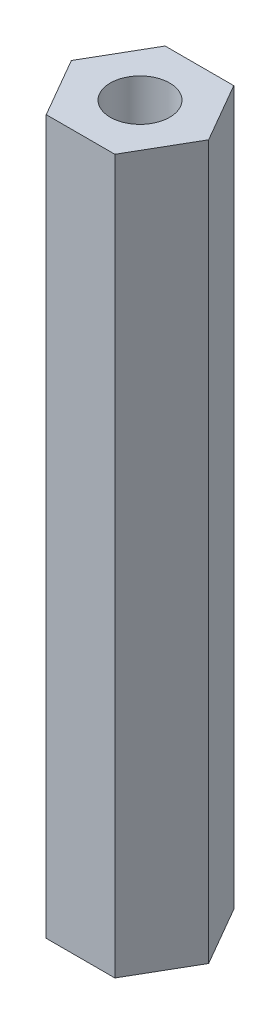
ISO-10303-21;
HEADER;
FILE_DESCRIPTION(('STEP AP214'),'2;1');
FILE_NAME('part.step','',(''),(''),'','','');
FILE_SCHEMA(('AUTOMOTIVE_DESIGN { 1 0 10303 214 1 1 1 1 }'));
ENDSEC;
DATA;
#1=APPLICATION_CONTEXT('core data for automotive mechanical design processes');
#2=APPLICATION_PROTOCOL_DEFINITION('international standard','automotive_design',2000,#1);
#3=PRODUCT_CONTEXT('',#1,'mechanical');
#4=PRODUCT('Part','Part','',(#3));
#5=PRODUCT_RELATED_PRODUCT_CATEGORY('part','',(#4));
#6=PRODUCT_DEFINITION_FORMATION('','',#4);
#7=PRODUCT_DEFINITION_CONTEXT('part definition',#1,'design');
#8=PRODUCT_DEFINITION('design','',#6,#7);
#9=PRODUCT_DEFINITION_SHAPE('','',#8);
#10=(LENGTH_UNIT() NAMED_UNIT(*) SI_UNIT(.MILLI.,.METRE.));
#11=(NAMED_UNIT(*) PLANE_ANGLE_UNIT() SI_UNIT($,.RADIAN.));
#12=(NAMED_UNIT(*) SI_UNIT($,.STERADIAN.) SOLID_ANGLE_UNIT());
#13=UNCERTAINTY_MEASURE_WITH_UNIT(LENGTH_MEASURE(1.E-05),#10,'distance_accuracy_value','');
#14=(GEOMETRIC_REPRESENTATION_CONTEXT(3) GLOBAL_UNCERTAINTY_ASSIGNED_CONTEXT((#13)) GLOBAL_UNIT_ASSIGNED_CONTEXT((#10,
#11,#12)) REPRESENTATION_CONTEXT('',''));
#15=CARTESIAN_POINT('',(0.,0.,0.));
#16=DIRECTION('',(0.,0.,1.));
#17=DIRECTION('',(1.,0.,0.));
#18=AXIS2_PLACEMENT_3D('',#15,#16,#17);
#19=CARTESIAN_POINT('',(0.,38.1,0.));
#20=DIRECTION('',(0.,1.,0.));
#21=DIRECTION('',(0.,0.,1.));
#22=AXIS2_PLACEMENT_3D('',#19,#20,#21);
#23=PLANE('',#22);
#24=DIRECTION('',(1.,0.,0.));
#25=VECTOR('',#24,1.);
#26=CARTESIAN_POINT('',(-3.66617420935412,38.1,6.35));
#27=LINE('',#26,#25);
#28=CARTESIAN_POINT('',(-3.66617420935412,38.1,6.35));
#29=VERTEX_POINT('',#28);
#30=CARTESIAN_POINT('',(3.66617420935413,38.1,6.35));
#31=VERTEX_POINT('',#30);
#32=EDGE_CURVE('E129',#29,#31,#27,.T.);
#33=ORIENTED_EDGE('',*,*,#32,.T.);
#34=DIRECTION('',(0.5,0.,-0.866025403784439));
#35=VECTOR('',#34,1.);
#36=CARTESIAN_POINT('',(3.66617420935413,38.1,6.35));
#37=LINE('',#36,#35);
#38=CARTESIAN_POINT('',(7.33234841870825,38.1,0.));
#39=VERTEX_POINT('',#38);
#40=EDGE_CURVE('E87',#31,#39,#37,.T.);
#41=ORIENTED_EDGE('',*,*,#40,.T.);
#42=DIRECTION('',(-0.500000000000001,0.,-0.866025403784438));
#43=VECTOR('',#42,1.);
#44=CARTESIAN_POINT('',(7.33234841870825,38.1,0.));
#45=LINE('',#44,#43);
#46=CARTESIAN_POINT('',(3.66617420935412,38.1,-6.35));
#47=VERTEX_POINT('',#46);
#48=EDGE_CURVE('E100',#39,#47,#45,.T.);
#49=ORIENTED_EDGE('',*,*,#48,.T.);
#50=DIRECTION('',(-1.,0.,0.));
#51=VECTOR('',#50,1.);
#52=CARTESIAN_POINT('',(3.66617420935412,38.1,-6.35));
#53=LINE('',#52,#51);
#54=CARTESIAN_POINT('',(-3.66617420935413,38.1,-6.35));
#55=VERTEX_POINT('',#54);
#56=EDGE_CURVE('E94',#47,#55,#53,.T.);
#57=ORIENTED_EDGE('',*,*,#56,.T.);
#58=DIRECTION('',(-0.5,0.,0.866025403784439));
#59=VECTOR('',#58,1.);
#60=CARTESIAN_POINT('',(-3.66617420935413,38.1,-6.35));
#61=LINE('',#60,#59);
#62=CARTESIAN_POINT('',(-7.33234841870825,38.1,0.));
#63=VERTEX_POINT('',#62);
#64=EDGE_CURVE('E98',#55,#63,#61,.T.);
#65=ORIENTED_EDGE('',*,*,#64,.T.);
#66=DIRECTION('',(0.5,0.,0.866025403784438));
#67=VECTOR('',#66,1.);
#68=CARTESIAN_POINT('',(-7.33234841870825,38.1,0.));
#69=LINE('',#68,#67);
#70=EDGE_CURVE('E50',#63,#29,#69,.T.);
#71=ORIENTED_EDGE('',*,*,#70,.T.);
#72=EDGE_LOOP('',(#33,#41,#49,#57,#65,#71));
#73=FACE_BOUND('',#72,.T.);
#74=CARTESIAN_POINT('',(0.,38.1,0.));
#75=DIRECTION('',(0.,1.,0.));
#76=DIRECTION('',(0.,0.,1.));
#77=AXIS2_PLACEMENT_3D('',#74,#75,#76);
#78=CIRCLE('',#77,3.175);
#79=CARTESIAN_POINT('',(0.,38.1,3.175));
#80=VERTEX_POINT('',#79);
#81=EDGE_CURVE('E122',#80,#80,#78,.T.);
#82=ORIENTED_EDGE('',*,*,#81,.F.);
#83=EDGE_LOOP('',(#82));
#84=FACE_BOUND('',#83,.T.);
#85=ADVANCED_FACE('F33',(#73,#84),#23,.T.);
#86=CARTESIAN_POINT('',(0.,-38.1,0.));
#87=DIRECTION('',(0.,1.,0.));
#88=DIRECTION('',(0.,0.,1.));
#89=AXIS2_PLACEMENT_3D('',#86,#87,#88);
#90=PLANE('',#89);
#91=DIRECTION('',(1.,0.,0.));
#92=VECTOR('',#91,1.);
#93=CARTESIAN_POINT('',(-3.66617420935412,-38.1,6.35));
#94=LINE('',#93,#92);
#95=CARTESIAN_POINT('',(-3.66617420935412,-38.1,6.35));
#96=VERTEX_POINT('',#95);
#97=CARTESIAN_POINT('',(3.66617420935413,-38.1,6.35));
#98=VERTEX_POINT('',#97);
#99=EDGE_CURVE('E118',#96,#98,#94,.T.);
#100=ORIENTED_EDGE('',*,*,#99,.F.);
#101=DIRECTION('',(0.5,0.,0.866025403784438));
#102=VECTOR('',#101,1.);
#103=CARTESIAN_POINT('',(-7.33234841870825,-38.1,0.));
#104=LINE('',#103,#102);
#105=CARTESIAN_POINT('',(-7.33234841870825,-38.1,0.));
#106=VERTEX_POINT('',#105);
#107=EDGE_CURVE('E79',#106,#96,#104,.T.);
#108=ORIENTED_EDGE('',*,*,#107,.F.);
#109=DIRECTION('',(-0.5,0.,0.866025403784439));
#110=VECTOR('',#109,1.);
#111=CARTESIAN_POINT('',(-3.66617420935413,-38.1,-6.35));
#112=LINE('',#111,#110);
#113=CARTESIAN_POINT('',(-3.66617420935413,-38.1,-6.35));
#114=VERTEX_POINT('',#113);
#115=EDGE_CURVE('E73',#114,#106,#112,.T.);
#116=ORIENTED_EDGE('',*,*,#115,.F.);
#117=DIRECTION('',(-1.,0.,0.));
#118=VECTOR('',#117,1.);
#119=CARTESIAN_POINT('',(3.66617420935412,-38.1,-6.35));
#120=LINE('',#119,#118);
#121=CARTESIAN_POINT('',(3.66617420935412,-38.1,-6.35));
#122=VERTEX_POINT('',#121);
#123=EDGE_CURVE('E108',#122,#114,#120,.T.);
#124=ORIENTED_EDGE('',*,*,#123,.F.);
#125=DIRECTION('',(-0.500000000000001,0.,-0.866025403784438));
#126=VECTOR('',#125,1.);
#127=CARTESIAN_POINT('',(7.33234841870825,-38.1,0.));
#128=LINE('',#127,#126);
#129=CARTESIAN_POINT('',(7.33234841870825,-38.1,0.));
#130=VERTEX_POINT('',#129);
#131=EDGE_CURVE('E124',#130,#122,#128,.T.);
#132=ORIENTED_EDGE('',*,*,#131,.F.);
#133=DIRECTION('',(0.5,0.,-0.866025403784439));
#134=VECTOR('',#133,1.);
#135=CARTESIAN_POINT('',(3.66617420935413,-38.1,6.35));
#136=LINE('',#135,#134);
#137=EDGE_CURVE('E121',#98,#130,#136,.T.);
#138=ORIENTED_EDGE('',*,*,#137,.F.);
#139=EDGE_LOOP('',(#100,#108,#116,#124,#132,#138));
#140=FACE_BOUND('',#139,.T.);
#141=CARTESIAN_POINT('',(0.,-38.1,0.));
#142=DIRECTION('',(0.,1.,0.));
#143=DIRECTION('',(0.,0.,1.));
#144=AXIS2_PLACEMENT_3D('',#141,#142,#143);
#145=CIRCLE('',#144,3.175);
#146=CARTESIAN_POINT('',(0.,-38.1,3.175));
#147=VERTEX_POINT('',#146);
#148=EDGE_CURVE('E222',#147,#147,#145,.T.);
#149=ORIENTED_EDGE('',*,*,#148,.T.);
#150=EDGE_LOOP('',(#149));
#151=FACE_BOUND('',#150,.T.);
#152=ADVANCED_FACE('F138',(#140,#151),#90,.F.);
#153=CARTESIAN_POINT('',(-3.66617420935412,38.1,6.35));
#154=DIRECTION('',(0.,0.,-1.));
#155=DIRECTION('',(-1.,0.,0.));
#156=AXIS2_PLACEMENT_3D('',#153,#154,#155);
#157=PLANE('',#156);
#158=ORIENTED_EDGE('',*,*,#99,.T.);
#159=DIRECTION('',(0.,-1.,0.));
#160=VECTOR('',#159,1.);
#161=CARTESIAN_POINT('',(3.66617420935413,38.1,6.35));
#162=LINE('',#161,#160);
#163=EDGE_CURVE('E11',#31,#98,#162,.T.);
#164=ORIENTED_EDGE('',*,*,#163,.F.);
#165=ORIENTED_EDGE('',*,*,#32,.F.);
#166=DIRECTION('',(0.,-1.,0.));
#167=VECTOR('',#166,1.);
#168=CARTESIAN_POINT('',(-3.66617420935412,38.1,6.35));
#169=LINE('',#168,#167);
#170=EDGE_CURVE('E114',#29,#96,#169,.T.);
#171=ORIENTED_EDGE('',*,*,#170,.T.);
#172=EDGE_LOOP('',(#158,#164,#165,#171));
#173=FACE_BOUND('',#172,.T.);
#174=ADVANCED_FACE('F35',(#173),#157,.F.);
#175=CARTESIAN_POINT('',(3.66617420935413,38.1,6.35));
#176=DIRECTION('',(-0.866025403784439,0.,-0.5));
#177=DIRECTION('',(-0.5,0.,0.866025403784439));
#178=AXIS2_PLACEMENT_3D('',#175,#176,#177);
#179=PLANE('',#178);
#180=ORIENTED_EDGE('',*,*,#137,.T.);
#181=DIRECTION('',(0.,-1.,0.));
#182=VECTOR('',#181,1.);
#183=CARTESIAN_POINT('',(7.33234841870825,38.1,0.));
#184=LINE('',#183,#182);
#185=EDGE_CURVE('E42',#39,#130,#184,.T.);
#186=ORIENTED_EDGE('',*,*,#185,.F.);
#187=ORIENTED_EDGE('',*,*,#40,.F.);
#188=ORIENTED_EDGE('',*,*,#163,.T.);
#189=EDGE_LOOP('',(#180,#186,#187,#188));
#190=FACE_BOUND('',#189,.T.);
#191=ADVANCED_FACE('F163',(#190),#179,.F.);
#192=CARTESIAN_POINT('',(7.33234841870825,38.1,0.));
#193=DIRECTION('',(-0.866025403784438,0.,0.500000000000001));
#194=DIRECTION('',(0.500000000000001,0.,0.866025403784438));
#195=AXIS2_PLACEMENT_3D('',#192,#193,#194);
#196=PLANE('',#195);
#197=ORIENTED_EDGE('',*,*,#131,.T.);
#198=DIRECTION('',(0.,-1.,0.));
#199=VECTOR('',#198,1.);
#200=CARTESIAN_POINT('',(3.66617420935412,38.1,-6.35));
#201=LINE('',#200,#199);
#202=EDGE_CURVE('E109',#47,#122,#201,.T.);
#203=ORIENTED_EDGE('',*,*,#202,.F.);
#204=ORIENTED_EDGE('',*,*,#48,.F.);
#205=ORIENTED_EDGE('',*,*,#185,.T.);
#206=EDGE_LOOP('',(#197,#203,#204,#205));
#207=FACE_BOUND('',#206,.T.);
#208=ADVANCED_FACE('F135',(#207),#196,.F.);
#209=CARTESIAN_POINT('',(3.66617420935412,38.1,-6.35));
#210=DIRECTION('',(0.,0.,1.));
#211=DIRECTION('',(1.,0.,0.));
#212=AXIS2_PLACEMENT_3D('',#209,#210,#211);
#213=PLANE('',#212);
#214=ORIENTED_EDGE('',*,*,#123,.T.);
#215=DIRECTION('',(0.,-1.,0.));
#216=VECTOR('',#215,1.);
#217=CARTESIAN_POINT('',(-3.66617420935413,38.1,-6.35));
#218=LINE('',#217,#216);
#219=EDGE_CURVE('E105',#55,#114,#218,.T.);
#220=ORIENTED_EDGE('',*,*,#219,.F.);
#221=ORIENTED_EDGE('',*,*,#56,.F.);
#222=ORIENTED_EDGE('',*,*,#202,.T.);
#223=EDGE_LOOP('',(#214,#220,#221,#222));
#224=FACE_BOUND('',#223,.T.);
#225=ADVANCED_FACE('F106',(#224),#213,.F.);
#226=CARTESIAN_POINT('',(-3.66617420935413,38.1,-6.35));
#227=DIRECTION('',(0.866025403784439,0.,0.5));
#228=DIRECTION('',(0.5,0.,-0.866025403784439));
#229=AXIS2_PLACEMENT_3D('',#226,#227,#228);
#230=PLANE('',#229);
#231=ORIENTED_EDGE('',*,*,#115,.T.);
#232=DIRECTION('',(0.,-1.,0.));
#233=VECTOR('',#232,1.);
#234=CARTESIAN_POINT('',(-7.33234841870825,38.1,0.));
#235=LINE('',#234,#233);
#236=EDGE_CURVE('E110',#63,#106,#235,.T.);
#237=ORIENTED_EDGE('',*,*,#236,.F.);
#238=ORIENTED_EDGE('',*,*,#64,.F.);
#239=ORIENTED_EDGE('',*,*,#219,.T.);
#240=EDGE_LOOP('',(#231,#237,#238,#239));
#241=FACE_BOUND('',#240,.T.);
#242=ADVANCED_FACE('F112',(#241),#230,.F.);
#243=CARTESIAN_POINT('',(-7.33234841870825,38.1,0.));
#244=DIRECTION('',(0.866025403784438,0.,-0.500000000000001));
#245=DIRECTION('',(-0.500000000000001,0.,-0.866025403784438));
#246=AXIS2_PLACEMENT_3D('',#243,#244,#245);
#247=PLANE('',#246);
#248=ORIENTED_EDGE('',*,*,#107,.T.);
#249=ORIENTED_EDGE('',*,*,#170,.F.);
#250=ORIENTED_EDGE('',*,*,#70,.F.);
#251=ORIENTED_EDGE('',*,*,#236,.T.);
#252=EDGE_LOOP('',(#248,#249,#250,#251));
#253=FACE_BOUND('',#252,.T.);
#254=ADVANCED_FACE('F143',(#253),#247,.F.);
#255=CARTESIAN_POINT('',(0.,38.1,0.));
#256=DIRECTION('',(0.,-1.,0.));
#257=DIRECTION('',(0.,0.,-1.));
#258=AXIS2_PLACEMENT_3D('',#255,#256,#257);
#259=CYLINDRICAL_SURFACE('',#258,3.175);
#260=ORIENTED_EDGE('',*,*,#81,.T.);
#261=EDGE_LOOP('',(#260));
#262=FACE_BOUND('',#261,.T.);
#263=ORIENTED_EDGE('',*,*,#148,.F.);
#264=EDGE_LOOP('',(#263));
#265=FACE_BOUND('',#264,.T.);
#266=ADVANCED_FACE('F145',(#262,#265),#259,.F.);
#267=CLOSED_SHELL('',(#85,#152,#174,#191,#208,#225,#242,#254,#266));
#268=MANIFOLD_SOLID_BREP('B2',#267);
#269=ADVANCED_BREP_SHAPE_REPRESENTATION('',(#18,#268),#14);
#270=SHAPE_DEFINITION_REPRESENTATION(#9,#269);
ENDSEC;
END-ISO-10303-21;
